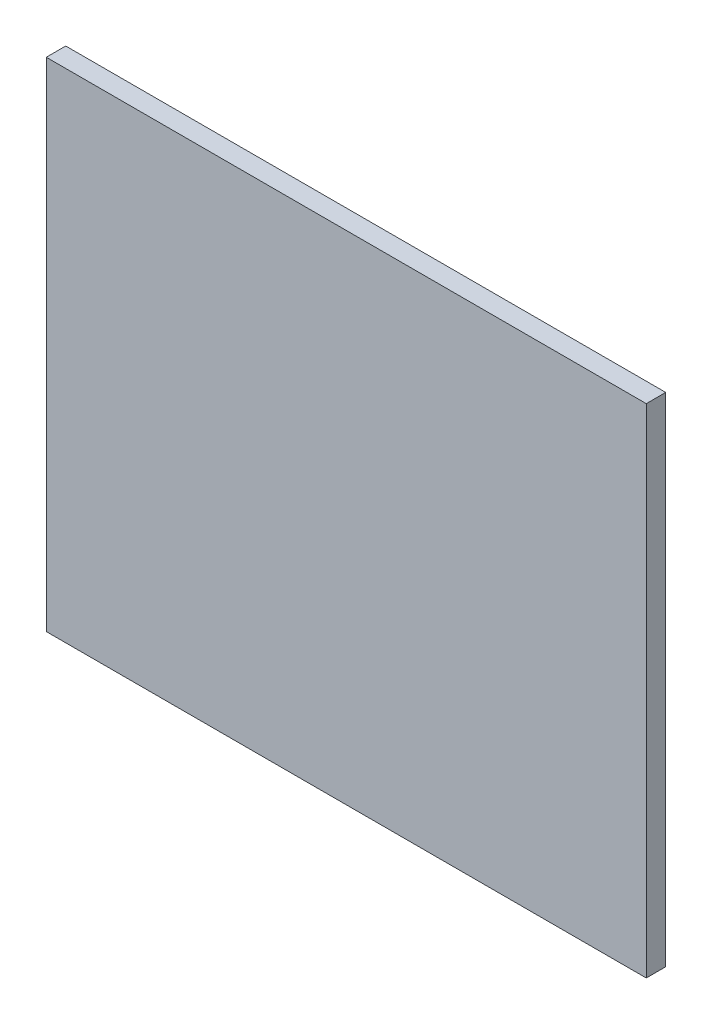
ISO-10303-21;
HEADER;
FILE_DESCRIPTION(('STEP AP214'),'2;1');
FILE_NAME('part.step','',(''),(''),'','','');
FILE_SCHEMA(('AUTOMOTIVE_DESIGN { 1 0 10303 214 1 1 1 1 }'));
ENDSEC;
DATA;
#1=APPLICATION_CONTEXT('core data for automotive mechanical design processes');
#2=APPLICATION_PROTOCOL_DEFINITION('international standard','automotive_design',2000,#1);
#3=PRODUCT_CONTEXT('',#1,'mechanical');
#4=PRODUCT('Part','Part','',(#3));
#5=PRODUCT_RELATED_PRODUCT_CATEGORY('part','',(#4));
#6=PRODUCT_DEFINITION_FORMATION('','',#4);
#7=PRODUCT_DEFINITION_CONTEXT('part definition',#1,'design');
#8=PRODUCT_DEFINITION('design','',#6,#7);
#9=PRODUCT_DEFINITION_SHAPE('','',#8);
#10=(LENGTH_UNIT() NAMED_UNIT(*) SI_UNIT(.MILLI.,.METRE.));
#11=(NAMED_UNIT(*) PLANE_ANGLE_UNIT() SI_UNIT($,.RADIAN.));
#12=(NAMED_UNIT(*) SI_UNIT($,.STERADIAN.) SOLID_ANGLE_UNIT());
#13=UNCERTAINTY_MEASURE_WITH_UNIT(LENGTH_MEASURE(1.E-05),#10,'distance_accuracy_value','');
#14=(GEOMETRIC_REPRESENTATION_CONTEXT(3) GLOBAL_UNCERTAINTY_ASSIGNED_CONTEXT((#13)) GLOBAL_UNIT_ASSIGNED_CONTEXT((#10,
#11,#12)) REPRESENTATION_CONTEXT('',''));
#15=CARTESIAN_POINT('',(0.,0.,0.));
#16=DIRECTION('',(0.,0.,1.));
#17=DIRECTION('',(1.,0.,0.));
#18=AXIS2_PLACEMENT_3D('',#15,#16,#17);
#19=CARTESIAN_POINT('',(-43.3554841897465,21.6286277427255,-1.89738));
#20=DIRECTION('',(-1.,0.,0.));
#21=DIRECTION('',(0.,-1.,0.));
#22=AXIS2_PLACEMENT_3D('',#19,#20,#21);
#23=PLANE('',#22);
#24=DIRECTION('',(0.,-1.,0.));
#25=VECTOR('',#24,1.);
#26=CARTESIAN_POINT('',(-43.3554841897465,21.6286277427255,0.));
#27=LINE('',#26,#25);
#28=CARTESIAN_POINT('',(-43.3554841897465,21.6286277427255,0.));
#29=VERTEX_POINT('',#28);
#30=CARTESIAN_POINT('',(-43.3554841897465,-26.8713722572746,0.));
#31=VERTEX_POINT('',#30);
#32=EDGE_CURVE('E99',#29,#31,#27,.T.);
#33=ORIENTED_EDGE('',*,*,#32,.F.);
#34=DIRECTION('',(0.,0.,1.));
#35=VECTOR('',#34,1.);
#36=CARTESIAN_POINT('',(-43.3554841897465,21.6286277427255,-1.89738));
#37=LINE('',#36,#35);
#38=CARTESIAN_POINT('',(-43.3554841897465,21.6286277427255,-1.89738));
#39=VERTEX_POINT('',#38);
#40=EDGE_CURVE('E11',#39,#29,#37,.T.);
#41=ORIENTED_EDGE('',*,*,#40,.F.);
#42=DIRECTION('',(0.,-1.,0.));
#43=VECTOR('',#42,1.);
#44=CARTESIAN_POINT('',(-43.3554841897465,21.6286277427255,-1.89738));
#45=LINE('',#44,#43);
#46=CARTESIAN_POINT('',(-43.3554841897465,-26.8713722572746,-1.89738));
#47=VERTEX_POINT('',#46);
#48=EDGE_CURVE('E93',#39,#47,#45,.T.);
#49=ORIENTED_EDGE('',*,*,#48,.T.);
#50=DIRECTION('',(0.,0.,1.));
#51=VECTOR('',#50,1.);
#52=CARTESIAN_POINT('',(-43.3554841897465,-26.8713722572746,-1.89738));
#53=LINE('',#52,#51);
#54=EDGE_CURVE('E38',#47,#31,#53,.T.);
#55=ORIENTED_EDGE('',*,*,#54,.T.);
#56=EDGE_LOOP('',(#33,#41,#49,#55));
#57=FACE_BOUND('',#56,.T.);
#58=ADVANCED_FACE('F35',(#57),#23,.T.);
#59=CARTESIAN_POINT('',(-43.3554841897465,21.6286277427255,-1.89738));
#60=DIRECTION('',(0.,1.,0.));
#61=DIRECTION('',(0.,0.,1.));
#62=AXIS2_PLACEMENT_3D('',#59,#60,#61);
#63=PLANE('',#62);
#64=DIRECTION('',(-1.,0.,0.));
#65=VECTOR('',#64,1.);
#66=CARTESIAN_POINT('',(-43.3554841897465,21.6286277427255,0.));
#67=LINE('',#66,#65);
#68=CARTESIAN_POINT('',(15.1445158102535,21.6286277427255,0.));
#69=VERTEX_POINT('',#68);
#70=EDGE_CURVE('E95',#69,#29,#67,.T.);
#71=ORIENTED_EDGE('',*,*,#70,.F.);
#72=DIRECTION('',(0.,0.,1.));
#73=VECTOR('',#72,1.);
#74=CARTESIAN_POINT('',(15.1445158102535,21.6286277427255,-1.89738));
#75=LINE('',#74,#73);
#76=CARTESIAN_POINT('',(15.1445158102535,21.6286277427255,-1.89738));
#77=VERTEX_POINT('',#76);
#78=EDGE_CURVE('E44',#77,#69,#75,.T.);
#79=ORIENTED_EDGE('',*,*,#78,.F.);
#80=DIRECTION('',(-1.,0.,0.));
#81=VECTOR('',#80,1.);
#82=CARTESIAN_POINT('',(-43.3554841897465,21.6286277427255,-1.89738));
#83=LINE('',#82,#81);
#84=EDGE_CURVE('E90',#77,#39,#83,.T.);
#85=ORIENTED_EDGE('',*,*,#84,.T.);
#86=ORIENTED_EDGE('',*,*,#40,.T.);
#87=EDGE_LOOP('',(#71,#79,#85,#86));
#88=FACE_BOUND('',#87,.T.);
#89=ADVANCED_FACE('F109',(#88),#63,.T.);
#90=CARTESIAN_POINT('',(15.1445158102535,21.6286277427255,-1.89738));
#91=DIRECTION('',(1.,0.,0.));
#92=DIRECTION('',(0.,1.,0.));
#93=AXIS2_PLACEMENT_3D('',#90,#91,#92);
#94=PLANE('',#93);
#95=DIRECTION('',(0.,1.,0.));
#96=VECTOR('',#95,1.);
#97=CARTESIAN_POINT('',(15.1445158102535,21.6286277427255,0.));
#98=LINE('',#97,#96);
#99=CARTESIAN_POINT('',(15.1445158102535,-26.8713722572746,0.));
#100=VERTEX_POINT('',#99);
#101=EDGE_CURVE('E85',#100,#69,#98,.T.);
#102=ORIENTED_EDGE('',*,*,#101,.F.);
#103=DIRECTION('',(0.,0.,1.));
#104=VECTOR('',#103,1.);
#105=CARTESIAN_POINT('',(15.1445158102535,-26.8713722572746,-1.89738));
#106=LINE('',#105,#104);
#107=CARTESIAN_POINT('',(15.1445158102535,-26.8713722572746,-1.89738));
#108=VERTEX_POINT('',#107);
#109=EDGE_CURVE('E80',#108,#100,#106,.T.);
#110=ORIENTED_EDGE('',*,*,#109,.F.);
#111=DIRECTION('',(0.,1.,0.));
#112=VECTOR('',#111,1.);
#113=CARTESIAN_POINT('',(15.1445158102535,21.6286277427255,-1.89738));
#114=LINE('',#113,#112);
#115=EDGE_CURVE('E83',#108,#77,#114,.T.);
#116=ORIENTED_EDGE('',*,*,#115,.T.);
#117=ORIENTED_EDGE('',*,*,#78,.T.);
#118=EDGE_LOOP('',(#102,#110,#116,#117));
#119=FACE_BOUND('',#118,.T.);
#120=ADVANCED_FACE('F82',(#119),#94,.T.);
#121=CARTESIAN_POINT('',(-43.3554841897465,-26.8713722572746,-1.89738));
#122=DIRECTION('',(0.,-1.,0.));
#123=DIRECTION('',(0.,0.,-1.));
#124=AXIS2_PLACEMENT_3D('',#121,#122,#123);
#125=PLANE('',#124);
#126=DIRECTION('',(1.,0.,0.));
#127=VECTOR('',#126,1.);
#128=CARTESIAN_POINT('',(-43.3554841897465,-26.8713722572746,0.));
#129=LINE('',#128,#127);
#130=EDGE_CURVE('E102',#31,#100,#129,.T.);
#131=ORIENTED_EDGE('',*,*,#130,.F.);
#132=ORIENTED_EDGE('',*,*,#54,.F.);
#133=DIRECTION('',(1.,0.,0.));
#134=VECTOR('',#133,1.);
#135=CARTESIAN_POINT('',(-43.3554841897465,-26.8713722572746,-1.89738));
#136=LINE('',#135,#134);
#137=EDGE_CURVE('E89',#47,#108,#136,.T.);
#138=ORIENTED_EDGE('',*,*,#137,.T.);
#139=ORIENTED_EDGE('',*,*,#109,.T.);
#140=EDGE_LOOP('',(#131,#132,#138,#139));
#141=FACE_BOUND('',#140,.T.);
#142=ADVANCED_FACE('F92',(#141),#125,.T.);
#143=CARTESIAN_POINT('',(0.,0.,-1.89738));
#144=DIRECTION('',(0.,0.,1.));
#145=DIRECTION('',(1.,0.,0.));
#146=AXIS2_PLACEMENT_3D('',#143,#144,#145);
#147=PLANE('',#146);
#148=ORIENTED_EDGE('',*,*,#48,.F.);
#149=ORIENTED_EDGE('',*,*,#84,.F.);
#150=ORIENTED_EDGE('',*,*,#115,.F.);
#151=ORIENTED_EDGE('',*,*,#137,.F.);
#152=EDGE_LOOP('',(#148,#149,#150,#151));
#153=FACE_BOUND('',#152,.T.);
#154=ADVANCED_FACE('F88',(#153),#147,.F.);
#155=CARTESIAN_POINT('',(0.,0.,0.));
#156=DIRECTION('',(0.,0.,1.));
#157=DIRECTION('',(1.,0.,0.));
#158=AXIS2_PLACEMENT_3D('',#155,#156,#157);
#159=PLANE('',#158);
#160=ORIENTED_EDGE('',*,*,#32,.T.);
#161=ORIENTED_EDGE('',*,*,#130,.T.);
#162=ORIENTED_EDGE('',*,*,#101,.T.);
#163=ORIENTED_EDGE('',*,*,#70,.T.);
#164=EDGE_LOOP('',(#160,#161,#162,#163));
#165=FACE_BOUND('',#164,.T.);
#166=ADVANCED_FACE('F108',(#165),#159,.T.);
#167=CLOSED_SHELL('',(#58,#89,#120,#142,#154,#166));
#168=MANIFOLD_SOLID_BREP('B2',#167);
#169=ADVANCED_BREP_SHAPE_REPRESENTATION('',(#18,#168),#14);
#170=SHAPE_DEFINITION_REPRESENTATION(#9,#169);
ENDSEC;
END-ISO-10303-21;
